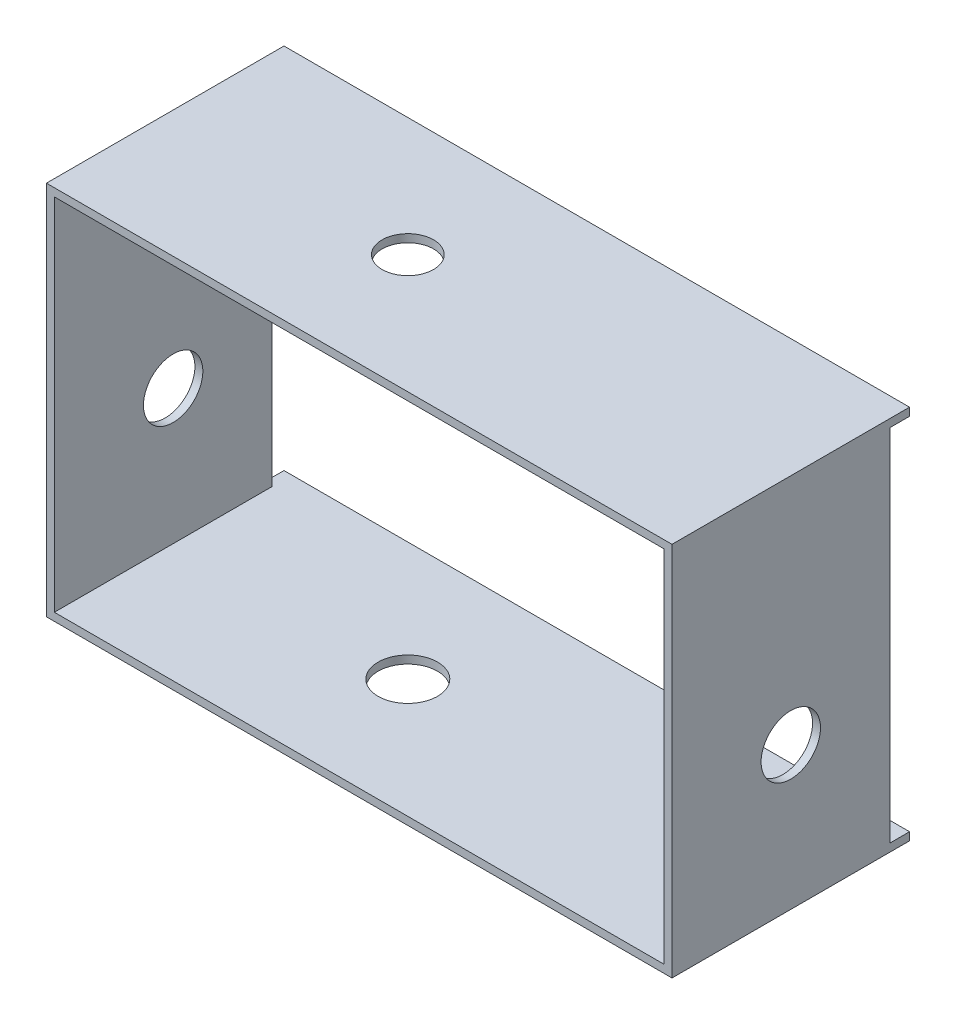
ISO-10303-21;
HEADER;
FILE_DESCRIPTION(('STEP AP214'),'2;1');
FILE_NAME('part.step','',(''),(''),'','','');
FILE_SCHEMA(('AUTOMOTIVE_DESIGN { 1 0 10303 214 1 1 1 1 }'));
ENDSEC;
DATA;
#1=APPLICATION_CONTEXT('core data for automotive mechanical design processes');
#2=APPLICATION_PROTOCOL_DEFINITION('international standard','automotive_design',2000,#1);
#3=PRODUCT_CONTEXT('',#1,'mechanical');
#4=PRODUCT('Part','Part','',(#3));
#5=PRODUCT_RELATED_PRODUCT_CATEGORY('part','',(#4));
#6=PRODUCT_DEFINITION_FORMATION('','',#4);
#7=PRODUCT_DEFINITION_CONTEXT('part definition',#1,'design');
#8=PRODUCT_DEFINITION('design','',#6,#7);
#9=PRODUCT_DEFINITION_SHAPE('','',#8);
#10=(LENGTH_UNIT() NAMED_UNIT(*) SI_UNIT(.MILLI.,.METRE.));
#11=(NAMED_UNIT(*) PLANE_ANGLE_UNIT() SI_UNIT($,.RADIAN.));
#12=(NAMED_UNIT(*) SI_UNIT($,.STERADIAN.) SOLID_ANGLE_UNIT());
#13=UNCERTAINTY_MEASURE_WITH_UNIT(LENGTH_MEASURE(1.E-05),#10,'distance_accuracy_value','');
#14=(GEOMETRIC_REPRESENTATION_CONTEXT(3) GLOBAL_UNCERTAINTY_ASSIGNED_CONTEXT((#13)) GLOBAL_UNIT_ASSIGNED_CONTEXT((#10,
#11,#12)) REPRESENTATION_CONTEXT('',''));
#15=CARTESIAN_POINT('',(0.,0.,0.));
#16=DIRECTION('',(0.,0.,1.));
#17=DIRECTION('',(1.,0.,0.));
#18=AXIS2_PLACEMENT_3D('',#15,#16,#17);
#19=CARTESIAN_POINT('',(195.58,0.,0.));
#20=DIRECTION('',(1.,0.,0.));
#21=DIRECTION('',(0.,0.,-1.));
#22=AXIS2_PLACEMENT_3D('',#19,#20,#21);
#23=PLANE('',#22);
#24=CARTESIAN_POINT('',(195.58,-72.2162450023476,-38.1));
#25=DIRECTION('',(1.,0.,0.));
#26=DIRECTION('',(0.,0.,-1.));
#27=AXIS2_PLACEMENT_3D('',#24,#25,#26);
#28=CIRCLE('',#27,9.525);
#29=CARTESIAN_POINT('',(195.58,-72.2162450023476,-47.625));
#30=VERTEX_POINT('',#29);
#31=EDGE_CURVE('E219',#30,#30,#28,.T.);
#32=ORIENTED_EDGE('',*,*,#31,.T.);
#33=EDGE_LOOP('',(#32));
#34=FACE_BOUND('',#33,.T.);
#35=DIRECTION('',(0.,0.,-1.));
#36=VECTOR('',#35,1.);
#37=CARTESIAN_POINT('',(195.58,-115.396245002348,0.));
#38=LINE('',#37,#36);
#39=CARTESIAN_POINT('',(195.58,-115.396245002348,6.56169603601951E-13));
#40=VERTEX_POINT('',#39);
#41=CARTESIAN_POINT('',(195.58,-115.396245002348,-69.85));
#42=VERTEX_POINT('',#41);
#43=EDGE_CURVE('E216',#40,#42,#38,.T.);
#44=ORIENTED_EDGE('',*,*,#43,.F.);
#45=DIRECTION('',(0.,-1.,0.));
#46=VECTOR('',#45,1.);
#47=CARTESIAN_POINT('',(195.58,0.,0.));
#48=LINE('',#47,#46);
#49=CARTESIAN_POINT('',(195.58,0.,0.));
#50=VERTEX_POINT('',#49);
#51=EDGE_CURVE('E225',#50,#40,#48,.T.);
#52=ORIENTED_EDGE('',*,*,#51,.F.);
#53=DIRECTION('',(0.,0.,-1.));
#54=VECTOR('',#53,1.);
#55=CARTESIAN_POINT('',(195.58,0.,0.));
#56=LINE('',#55,#54);
#57=CARTESIAN_POINT('',(195.58,0.,-69.85));
#58=VERTEX_POINT('',#57);
#59=EDGE_CURVE('E67',#50,#58,#56,.T.);
#60=ORIENTED_EDGE('',*,*,#59,.T.);
#61=DIRECTION('',(0.,-1.,0.));
#62=VECTOR('',#61,1.);
#63=CARTESIAN_POINT('',(195.58,0.,-69.85));
#64=LINE('',#63,#62);
#65=EDGE_CURVE('E256',#58,#42,#64,.T.);
#66=ORIENTED_EDGE('',*,*,#65,.T.);
#67=EDGE_LOOP('',(#44,#52,#60,#66));
#68=FACE_BOUND('',#67,.T.);
#69=ADVANCED_FACE('F41',(#34,#68),#23,.F.);
#70=CARTESIAN_POINT('',(0.,2.54,0.));
#71=DIRECTION('',(0.,-1.,0.));
#72=DIRECTION('',(0.,0.,-1.));
#73=AXIS2_PLACEMENT_3D('',#70,#71,#72);
#74=PLANE('',#73);
#75=DIRECTION('',(-1.,0.,0.));
#76=VECTOR('',#75,1.);
#77=CARTESIAN_POINT('',(0.,2.54,-76.2));
#78=LINE('',#77,#76);
#79=CARTESIAN_POINT('',(198.12,2.54,-76.2));
#80=VERTEX_POINT('',#79);
#81=CARTESIAN_POINT('',(-2.54,2.54,-76.2));
#82=VERTEX_POINT('',#81);
#83=EDGE_CURVE('E11',#80,#82,#78,.T.);
#84=ORIENTED_EDGE('',*,*,#83,.T.);
#85=DIRECTION('',(0.,0.,-1.));
#86=VECTOR('',#85,1.);
#87=CARTESIAN_POINT('',(-2.54,2.54,-76.2));
#88=LINE('',#87,#86);
#89=CARTESIAN_POINT('',(-2.54,2.54,0.));
#90=VERTEX_POINT('',#89);
#91=EDGE_CURVE('E139',#90,#82,#88,.T.);
#92=ORIENTED_EDGE('',*,*,#91,.F.);
#93=DIRECTION('',(1.,0.,0.));
#94=VECTOR('',#93,1.);
#95=CARTESIAN_POINT('',(0.,2.54,0.));
#96=LINE('',#95,#94);
#97=CARTESIAN_POINT('',(198.12,2.54,0.));
#98=VERTEX_POINT('',#97);
#99=EDGE_CURVE('E51',#90,#98,#96,.T.);
#100=ORIENTED_EDGE('',*,*,#99,.T.);
#101=DIRECTION('',(0.,0.,1.));
#102=VECTOR('',#101,1.);
#103=CARTESIAN_POINT('',(198.12,2.54,0.));
#104=LINE('',#103,#102);
#105=EDGE_CURVE('E141',#80,#98,#104,.T.);
#106=ORIENTED_EDGE('',*,*,#105,.F.);
#107=EDGE_LOOP('',(#84,#92,#100,#106));
#108=FACE_BOUND('',#107,.T.);
#109=CARTESIAN_POINT('',(75.2856,2.54,-38.1));
#110=DIRECTION('',(0.,1.,0.));
#111=DIRECTION('',(0.,0.,1.));
#112=AXIS2_PLACEMENT_3D('',#109,#110,#111);
#113=CIRCLE('',#112,8.255);
#114=CARTESIAN_POINT('',(75.2856,2.54,-29.845));
#115=VERTEX_POINT('',#114);
#116=EDGE_CURVE('E278',#115,#115,#113,.T.);
#117=ORIENTED_EDGE('',*,*,#116,.F.);
#118=EDGE_LOOP('',(#117));
#119=FACE_BOUND('',#118,.T.);
#120=ADVANCED_FACE('F136',(#108,#119),#74,.F.);
#121=CARTESIAN_POINT('',(0.,0.,0.));
#122=DIRECTION('',(0.,-1.,0.));
#123=DIRECTION('',(0.,0.,-1.));
#124=AXIS2_PLACEMENT_3D('',#121,#122,#123);
#125=PLANE('',#124);
#126=DIRECTION('',(0.,0.,1.));
#127=VECTOR('',#126,1.);
#128=CARTESIAN_POINT('',(0.,0.,0.));
#129=LINE('',#128,#127);
#130=CARTESIAN_POINT('',(0.,0.,-69.85));
#131=VERTEX_POINT('',#130);
#132=CARTESIAN_POINT('',(0.,0.,0.));
#133=VERTEX_POINT('',#132);
#134=EDGE_CURVE('E59',#131,#133,#129,.T.);
#135=ORIENTED_EDGE('',*,*,#134,.F.);
#136=DIRECTION('',(1.,0.,0.));
#137=VECTOR('',#136,1.);
#138=CARTESIAN_POINT('',(-2.54,0.,-69.85));
#139=LINE('',#138,#137);
#140=CARTESIAN_POINT('',(-2.54,0.,-69.85));
#141=VERTEX_POINT('',#140);
#142=EDGE_CURVE('E196',#141,#131,#139,.T.);
#143=ORIENTED_EDGE('',*,*,#142,.F.);
#144=DIRECTION('',(0.,0.,1.));
#145=VECTOR('',#144,1.);
#146=CARTESIAN_POINT('',(-2.54,0.,-69.85));
#147=LINE('',#146,#145);
#148=CARTESIAN_POINT('',(-2.54,0.,-76.2));
#149=VERTEX_POINT('',#148);
#150=EDGE_CURVE('E151',#149,#141,#147,.T.);
#151=ORIENTED_EDGE('',*,*,#150,.F.);
#152=DIRECTION('',(-1.,0.,0.));
#153=VECTOR('',#152,1.);
#154=CARTESIAN_POINT('',(0.,0.,-76.2));
#155=LINE('',#154,#153);
#156=CARTESIAN_POINT('',(198.12,0.,-76.2));
#157=VERTEX_POINT('',#156);
#158=EDGE_CURVE('E45',#157,#149,#155,.T.);
#159=ORIENTED_EDGE('',*,*,#158,.F.);
#160=DIRECTION('',(0.,0.,-1.));
#161=VECTOR('',#160,1.);
#162=CARTESIAN_POINT('',(198.12,0.,0.));
#163=LINE('',#162,#161);
#164=CARTESIAN_POINT('',(198.12,0.,-69.85));
#165=VERTEX_POINT('',#164);
#166=EDGE_CURVE('E233',#165,#157,#163,.T.);
#167=ORIENTED_EDGE('',*,*,#166,.F.);
#168=DIRECTION('',(-1.,0.,0.));
#169=VECTOR('',#168,1.);
#170=CARTESIAN_POINT('',(198.12,0.,-69.85));
#171=LINE('',#170,#169);
#172=EDGE_CURVE('E270',#165,#58,#171,.T.);
#173=ORIENTED_EDGE('',*,*,#172,.T.);
#174=ORIENTED_EDGE('',*,*,#59,.F.);
#175=DIRECTION('',(1.,0.,0.));
#176=VECTOR('',#175,1.);
#177=CARTESIAN_POINT('',(0.,0.,0.));
#178=LINE('',#177,#176);
#179=EDGE_CURVE('E282',#133,#50,#178,.T.);
#180=ORIENTED_EDGE('',*,*,#179,.F.);
#181=EDGE_LOOP('',(#135,#143,#151,#159,#167,#173,#174,#180));
#182=FACE_BOUND('',#181,.T.);
#183=CARTESIAN_POINT('',(75.2856,0.,-38.1));
#184=DIRECTION('',(0.,1.,0.));
#185=DIRECTION('',(0.,0.,1.));
#186=AXIS2_PLACEMENT_3D('',#183,#184,#185);
#187=CIRCLE('',#186,8.255);
#188=CARTESIAN_POINT('',(75.2856,0.,-29.845));
#189=VERTEX_POINT('',#188);
#190=EDGE_CURVE('E277',#189,#189,#187,.T.);
#191=ORIENTED_EDGE('',*,*,#190,.T.);
#192=EDGE_LOOP('',(#191));
#193=FACE_BOUND('',#192,.T.);
#194=ADVANCED_FACE('F293',(#182,#193),#125,.T.);
#195=CARTESIAN_POINT('',(0.,2.54,0.));
#196=DIRECTION('',(0.,0.,-1.));
#197=DIRECTION('',(-1.,0.,0.));
#198=AXIS2_PLACEMENT_3D('',#195,#196,#197);
#199=PLANE('',#198);
#200=DIRECTION('',(0.,1.,0.));
#201=VECTOR('',#200,1.);
#202=CARTESIAN_POINT('',(0.,2.54,0.));
#203=LINE('',#202,#201);
#204=CARTESIAN_POINT('',(0.,-115.396245002348,0.));
#205=VERTEX_POINT('',#204);
#206=EDGE_CURVE('E160',#205,#133,#203,.T.);
#207=ORIENTED_EDGE('',*,*,#206,.T.);
#208=ORIENTED_EDGE('',*,*,#179,.T.);
#209=ORIENTED_EDGE('',*,*,#51,.T.);
#210=DIRECTION('',(-1.,0.,0.));
#211=VECTOR('',#210,1.);
#212=CARTESIAN_POINT('',(198.12,-115.396245002348,6.56169603601951E-13));
#213=LINE('',#212,#211);
#214=EDGE_CURVE('E206',#40,#205,#213,.T.);
#215=ORIENTED_EDGE('',*,*,#214,.T.);
#216=EDGE_LOOP('',(#207,#208,#209,#215));
#217=FACE_BOUND('',#216,.T.);
#218=DIRECTION('',(-1.,0.,0.));
#219=VECTOR('',#218,1.);
#220=CARTESIAN_POINT('',(198.12,-117.936245002348,6.56169603601951E-13));
#221=LINE('',#220,#219);
#222=CARTESIAN_POINT('',(198.12,-117.936245002348,6.56169603601951E-13));
#223=VERTEX_POINT('',#222);
#224=CARTESIAN_POINT('',(-2.54,-117.936245002348,0.));
#225=VERTEX_POINT('',#224);
#226=EDGE_CURVE('E267',#223,#225,#221,.T.);
#227=ORIENTED_EDGE('',*,*,#226,.F.);
#228=DIRECTION('',(0.,-1.,0.));
#229=VECTOR('',#228,1.);
#230=CARTESIAN_POINT('',(198.12,0.,0.));
#231=LINE('',#230,#229);
#232=EDGE_CURVE('E242',#98,#223,#231,.T.);
#233=ORIENTED_EDGE('',*,*,#232,.F.);
#234=ORIENTED_EDGE('',*,*,#99,.F.);
#235=DIRECTION('',(0.,1.,0.));
#236=VECTOR('',#235,1.);
#237=CARTESIAN_POINT('',(-2.54,-115.396245002348,0.));
#238=LINE('',#237,#236);
#239=EDGE_CURVE('E158',#225,#90,#238,.T.);
#240=ORIENTED_EDGE('',*,*,#239,.F.);
#241=EDGE_LOOP('',(#227,#233,#234,#240));
#242=FACE_BOUND('',#241,.T.);
#243=ADVANCED_FACE('F43',(#217,#242),#199,.F.);
#244=CARTESIAN_POINT('',(0.,2.54,-76.2));
#245=DIRECTION('',(0.,0.,1.));
#246=DIRECTION('',(1.,0.,0.));
#247=AXIS2_PLACEMENT_3D('',#244,#245,#246);
#248=PLANE('',#247);
#249=ORIENTED_EDGE('',*,*,#158,.T.);
#250=DIRECTION('',(0.,-1.,0.));
#251=VECTOR('',#250,1.);
#252=CARTESIAN_POINT('',(-2.54,0.,-76.2));
#253=LINE('',#252,#251);
#254=EDGE_CURVE('E146',#82,#149,#253,.T.);
#255=ORIENTED_EDGE('',*,*,#254,.F.);
#256=ORIENTED_EDGE('',*,*,#83,.F.);
#257=DIRECTION('',(0.,1.,0.));
#258=VECTOR('',#257,1.);
#259=CARTESIAN_POINT('',(198.12,0.,-76.2));
#260=LINE('',#259,#258);
#261=EDGE_CURVE('E237',#157,#80,#260,.T.);
#262=ORIENTED_EDGE('',*,*,#261,.F.);
#263=EDGE_LOOP('',(#249,#255,#256,#262));
#264=FACE_BOUND('',#263,.T.);
#265=ADVANCED_FACE('F147',(#264),#248,.F.);
#266=CARTESIAN_POINT('',(75.2856,2.54,-38.1));
#267=DIRECTION('',(0.,-1.,0.));
#268=DIRECTION('',(0.,0.,-1.));
#269=AXIS2_PLACEMENT_3D('',#266,#267,#268);
#270=CYLINDRICAL_SURFACE('',#269,8.255);
#271=ORIENTED_EDGE('',*,*,#116,.T.);
#272=EDGE_LOOP('',(#271));
#273=FACE_BOUND('',#272,.T.);
#274=ORIENTED_EDGE('',*,*,#190,.F.);
#275=EDGE_LOOP('',(#274));
#276=FACE_BOUND('',#275,.T.);
#277=ADVANCED_FACE('F329',(#273,#276),#270,.F.);
#278=CARTESIAN_POINT('',(198.12,-115.396245002348,0.));
#279=DIRECTION('',(0.,1.,0.));
#280=DIRECTION('',(0.,0.,1.));
#281=AXIS2_PLACEMENT_3D('',#278,#279,#280);
#282=PLANE('',#281);
#283=DIRECTION('',(-1.,0.,0.));
#284=VECTOR('',#283,1.);
#285=CARTESIAN_POINT('',(198.12,-115.396245002348,-76.2));
#286=LINE('',#285,#284);
#287=CARTESIAN_POINT('',(198.12,-115.396245002348,-76.2));
#288=VERTEX_POINT('',#287);
#289=CARTESIAN_POINT('',(-2.54,-115.396245002348,-76.2));
#290=VERTEX_POINT('',#289);
#291=EDGE_CURVE('E252',#288,#290,#286,.T.);
#292=ORIENTED_EDGE('',*,*,#291,.T.);
#293=DIRECTION('',(0.,0.,-1.));
#294=VECTOR('',#293,1.);
#295=CARTESIAN_POINT('',(-2.54,-115.396245002348,-76.2));
#296=LINE('',#295,#294);
#297=CARTESIAN_POINT('',(-2.54,-115.396245002348,-69.85));
#298=VERTEX_POINT('',#297);
#299=EDGE_CURVE('E175',#298,#290,#296,.T.);
#300=ORIENTED_EDGE('',*,*,#299,.F.);
#301=DIRECTION('',(1.,0.,0.));
#302=VECTOR('',#301,1.);
#303=CARTESIAN_POINT('',(-2.54,-115.396245002348,-69.85));
#304=LINE('',#303,#302);
#305=CARTESIAN_POINT('',(0.,-115.396245002348,-69.85));
#306=VERTEX_POINT('',#305);
#307=EDGE_CURVE('E188',#298,#306,#304,.T.);
#308=ORIENTED_EDGE('',*,*,#307,.T.);
#309=DIRECTION('',(0.,0.,-1.));
#310=VECTOR('',#309,1.);
#311=CARTESIAN_POINT('',(0.,-115.396245002348,0.));
#312=LINE('',#311,#310);
#313=EDGE_CURVE('E213',#205,#306,#312,.T.);
#314=ORIENTED_EDGE('',*,*,#313,.F.);
#315=ORIENTED_EDGE('',*,*,#214,.F.);
#316=ORIENTED_EDGE('',*,*,#43,.T.);
#317=DIRECTION('',(-1.,0.,0.));
#318=VECTOR('',#317,1.);
#319=CARTESIAN_POINT('',(198.12,-115.396245002348,-69.85));
#320=LINE('',#319,#318);
#321=CARTESIAN_POINT('',(198.12,-115.396245002348,-69.85));
#322=VERTEX_POINT('',#321);
#323=EDGE_CURVE('E273',#322,#42,#320,.T.);
#324=ORIENTED_EDGE('',*,*,#323,.F.);
#325=DIRECTION('',(0.,0.,-1.));
#326=VECTOR('',#325,1.);
#327=CARTESIAN_POINT('',(198.12,-115.396245002348,0.));
#328=LINE('',#327,#326);
#329=EDGE_CURVE('E224',#322,#288,#328,.T.);
#330=ORIENTED_EDGE('',*,*,#329,.T.);
#331=EDGE_LOOP('',(#292,#300,#308,#314,#315,#316,#324,#330));
#332=FACE_BOUND('',#331,.T.);
#333=CARTESIAN_POINT('',(75.2856,-115.396245002348,-38.1));
#334=DIRECTION('',(0.,-1.,0.));
#335=DIRECTION('',(0.,0.,-1.));
#336=AXIS2_PLACEMENT_3D('',#333,#334,#335);
#337=CIRCLE('',#336,9.52500000000001);
#338=CARTESIAN_POINT('',(75.2856,-115.396245002348,-47.625));
#339=VERTEX_POINT('',#338);
#340=EDGE_CURVE('E202',#339,#339,#337,.T.);
#341=ORIENTED_EDGE('',*,*,#340,.T.);
#342=EDGE_LOOP('',(#341));
#343=FACE_BOUND('',#342,.T.);
#344=ADVANCED_FACE('F299',(#332,#343),#282,.T.);
#345=CARTESIAN_POINT('',(198.12,0.,-69.85));
#346=DIRECTION('',(0.,0.,-1.));
#347=DIRECTION('',(-1.,0.,0.));
#348=AXIS2_PLACEMENT_3D('',#345,#346,#347);
#349=PLANE('',#348);
#350=ORIENTED_EDGE('',*,*,#65,.F.);
#351=ORIENTED_EDGE('',*,*,#172,.F.);
#352=DIRECTION('',(0.,-1.,0.));
#353=VECTOR('',#352,1.);
#354=CARTESIAN_POINT('',(198.12,0.,-69.85));
#355=LINE('',#354,#353);
#356=EDGE_CURVE('E229',#165,#322,#355,.T.);
#357=ORIENTED_EDGE('',*,*,#356,.T.);
#358=ORIENTED_EDGE('',*,*,#323,.T.);
#359=EDGE_LOOP('',(#350,#351,#357,#358));
#360=FACE_BOUND('',#359,.T.);
#361=ADVANCED_FACE('F304',(#360),#349,.T.);
#362=CARTESIAN_POINT('',(198.12,-117.936245002348,0.));
#363=DIRECTION('',(0.,1.,0.));
#364=DIRECTION('',(0.,0.,1.));
#365=AXIS2_PLACEMENT_3D('',#362,#363,#364);
#366=PLANE('',#365);
#367=ORIENTED_EDGE('',*,*,#226,.T.);
#368=DIRECTION('',(0.,0.,1.));
#369=VECTOR('',#368,1.);
#370=CARTESIAN_POINT('',(-2.54,-117.936245002348,0.));
#371=LINE('',#370,#369);
#372=CARTESIAN_POINT('',(-2.54,-117.936245002348,-76.2));
#373=VERTEX_POINT('',#372);
#374=EDGE_CURVE('E183',#373,#225,#371,.T.);
#375=ORIENTED_EDGE('',*,*,#374,.F.);
#376=DIRECTION('',(-1.,0.,0.));
#377=VECTOR('',#376,1.);
#378=CARTESIAN_POINT('',(198.12,-117.936245002348,-76.2));
#379=LINE('',#378,#377);
#380=CARTESIAN_POINT('',(198.12,-117.936245002348,-76.2));
#381=VERTEX_POINT('',#380);
#382=EDGE_CURVE('E264',#381,#373,#379,.T.);
#383=ORIENTED_EDGE('',*,*,#382,.F.);
#384=DIRECTION('',(0.,0.,-1.));
#385=VECTOR('',#384,1.);
#386=CARTESIAN_POINT('',(198.12,-117.936245002348,0.));
#387=LINE('',#386,#385);
#388=EDGE_CURVE('E245',#223,#381,#387,.T.);
#389=ORIENTED_EDGE('',*,*,#388,.F.);
#390=EDGE_LOOP('',(#367,#375,#383,#389));
#391=FACE_BOUND('',#390,.T.);
#392=CARTESIAN_POINT('',(75.2856,-117.936245002348,-38.1));
#393=DIRECTION('',(0.,-1.,0.));
#394=DIRECTION('',(0.,0.,-1.));
#395=AXIS2_PLACEMENT_3D('',#392,#393,#394);
#396=CIRCLE('',#395,9.52500000000001);
#397=CARTESIAN_POINT('',(75.2856,-117.936245002348,-47.625));
#398=VERTEX_POINT('',#397);
#399=EDGE_CURVE('E201',#398,#398,#396,.T.);
#400=ORIENTED_EDGE('',*,*,#399,.F.);
#401=EDGE_LOOP('',(#400));
#402=FACE_BOUND('',#401,.T.);
#403=ADVANCED_FACE('F320',(#391,#402),#366,.F.);
#404=CARTESIAN_POINT('',(198.12,-72.2162450023476,-38.1));
#405=DIRECTION('',(-1.,0.,0.));
#406=DIRECTION('',(0.,0.,1.));
#407=AXIS2_PLACEMENT_3D('',#404,#405,#406);
#408=CYLINDRICAL_SURFACE('',#407,9.525);
#409=CARTESIAN_POINT('',(198.12,-72.2162450023476,-38.1));
#410=DIRECTION('',(1.,0.,0.));
#411=DIRECTION('',(0.,0.,-1.));
#412=AXIS2_PLACEMENT_3D('',#409,#410,#411);
#413=CIRCLE('',#412,9.525);
#414=CARTESIAN_POINT('',(198.12,-72.2162450023476,-47.625));
#415=VERTEX_POINT('',#414);
#416=EDGE_CURVE('E220',#415,#415,#413,.T.);
#417=ORIENTED_EDGE('',*,*,#416,.T.);
#418=EDGE_LOOP('',(#417));
#419=FACE_BOUND('',#418,.T.);
#420=ORIENTED_EDGE('',*,*,#31,.F.);
#421=EDGE_LOOP('',(#420));
#422=FACE_BOUND('',#421,.T.);
#423=ADVANCED_FACE('F344',(#419,#422),#408,.F.);
#424=CARTESIAN_POINT('',(198.12,0.,-76.2));
#425=DIRECTION('',(0.,0.,1.));
#426=DIRECTION('',(1.,0.,0.));
#427=AXIS2_PLACEMENT_3D('',#424,#425,#426);
#428=PLANE('',#427);
#429=ORIENTED_EDGE('',*,*,#382,.T.);
#430=DIRECTION('',(0.,-1.,0.));
#431=VECTOR('',#430,1.);
#432=CARTESIAN_POINT('',(-2.54,-117.936245002348,-76.2));
#433=LINE('',#432,#431);
#434=EDGE_CURVE('E179',#290,#373,#433,.T.);
#435=ORIENTED_EDGE('',*,*,#434,.F.);
#436=ORIENTED_EDGE('',*,*,#291,.F.);
#437=DIRECTION('',(0.,1.,0.));
#438=VECTOR('',#437,1.);
#439=CARTESIAN_POINT('',(198.12,0.,-76.2));
#440=LINE('',#439,#438);
#441=EDGE_CURVE('E249',#381,#288,#440,.T.);
#442=ORIENTED_EDGE('',*,*,#441,.F.);
#443=EDGE_LOOP('',(#429,#435,#436,#442));
#444=FACE_BOUND('',#443,.T.);
#445=ADVANCED_FACE('F316',(#444),#428,.F.);
#446=CARTESIAN_POINT('',(198.12,0.,0.));
#447=DIRECTION('',(1.,0.,0.));
#448=DIRECTION('',(0.,0.,-1.));
#449=AXIS2_PLACEMENT_3D('',#446,#447,#448);
#450=PLANE('',#449);
#451=ORIENTED_EDGE('',*,*,#329,.F.);
#452=ORIENTED_EDGE('',*,*,#356,.F.);
#453=ORIENTED_EDGE('',*,*,#166,.T.);
#454=ORIENTED_EDGE('',*,*,#261,.T.);
#455=ORIENTED_EDGE('',*,*,#105,.T.);
#456=ORIENTED_EDGE('',*,*,#232,.T.);
#457=ORIENTED_EDGE('',*,*,#388,.T.);
#458=ORIENTED_EDGE('',*,*,#441,.T.);
#459=EDGE_LOOP('',(#451,#452,#453,#454,#455,#456,#457,#458));
#460=FACE_BOUND('',#459,.T.);
#461=ORIENTED_EDGE('',*,*,#416,.F.);
#462=EDGE_LOOP('',(#461));
#463=FACE_BOUND('',#462,.T.);
#464=ADVANCED_FACE('F307',(#460,#463),#450,.T.);
#465=CARTESIAN_POINT('',(75.2856,-115.396245002348,-38.1));
#466=DIRECTION('',(0.,-1.,0.));
#467=DIRECTION('',(0.,0.,-1.));
#468=AXIS2_PLACEMENT_3D('',#465,#466,#467);
#469=CYLINDRICAL_SURFACE('',#468,9.52500000000001);
#470=ORIENTED_EDGE('',*,*,#340,.F.);
#471=EDGE_LOOP('',(#470));
#472=FACE_BOUND('',#471,.T.);
#473=ORIENTED_EDGE('',*,*,#399,.T.);
#474=EDGE_LOOP('',(#473));
#475=FACE_BOUND('',#474,.T.);
#476=ADVANCED_FACE('F374',(#472,#475),#469,.F.);
#477=CARTESIAN_POINT('',(-2.54,0.,0.));
#478=DIRECTION('',(1.,0.,0.));
#479=DIRECTION('',(0.,0.,-1.));
#480=AXIS2_PLACEMENT_3D('',#477,#478,#479);
#481=PLANE('',#480);
#482=ORIENTED_EDGE('',*,*,#91,.T.);
#483=ORIENTED_EDGE('',*,*,#254,.T.);
#484=ORIENTED_EDGE('',*,*,#150,.T.);
#485=DIRECTION('',(0.,-1.,0.));
#486=VECTOR('',#485,1.);
#487=CARTESIAN_POINT('',(-2.54,-115.396245002348,-69.85));
#488=LINE('',#487,#486);
#489=EDGE_CURVE('E172',#141,#298,#488,.T.);
#490=ORIENTED_EDGE('',*,*,#489,.T.);
#491=ORIENTED_EDGE('',*,*,#299,.T.);
#492=ORIENTED_EDGE('',*,*,#434,.T.);
#493=ORIENTED_EDGE('',*,*,#374,.T.);
#494=ORIENTED_EDGE('',*,*,#239,.T.);
#495=EDGE_LOOP('',(#482,#483,#484,#490,#491,#492,#493,#494));
#496=FACE_BOUND('',#495,.T.);
#497=CARTESIAN_POINT('',(-2.54,-72.2162450023476,-38.1));
#498=DIRECTION('',(-1.,0.,0.));
#499=DIRECTION('',(0.,0.,1.));
#500=AXIS2_PLACEMENT_3D('',#497,#498,#499);
#501=CIRCLE('',#500,9.525);
#502=CARTESIAN_POINT('',(-2.54,-72.2162450023476,-28.575));
#503=VERTEX_POINT('',#502);
#504=EDGE_CURVE('E191',#503,#503,#501,.T.);
#505=ORIENTED_EDGE('',*,*,#504,.F.);
#506=EDGE_LOOP('',(#505));
#507=FACE_BOUND('',#506,.T.);
#508=ADVANCED_FACE('F154',(#496,#507),#481,.F.);
#509=CARTESIAN_POINT('',(0.,0.,0.));
#510=DIRECTION('',(1.,0.,0.));
#511=DIRECTION('',(0.,0.,-1.));
#512=AXIS2_PLACEMENT_3D('',#509,#510,#511);
#513=PLANE('',#512);
#514=DIRECTION('',(0.,-1.,0.));
#515=VECTOR('',#514,1.);
#516=CARTESIAN_POINT('',(0.,-115.396245002348,-69.85));
#517=LINE('',#516,#515);
#518=EDGE_CURVE('E164',#131,#306,#517,.T.);
#519=ORIENTED_EDGE('',*,*,#518,.F.);
#520=ORIENTED_EDGE('',*,*,#134,.T.);
#521=ORIENTED_EDGE('',*,*,#206,.F.);
#522=ORIENTED_EDGE('',*,*,#313,.T.);
#523=EDGE_LOOP('',(#519,#520,#521,#522));
#524=FACE_BOUND('',#523,.T.);
#525=CARTESIAN_POINT('',(0.,-72.2162450023476,-38.1));
#526=DIRECTION('',(-1.,0.,0.));
#527=DIRECTION('',(0.,0.,1.));
#528=AXIS2_PLACEMENT_3D('',#525,#526,#527);
#529=CIRCLE('',#528,9.525);
#530=CARTESIAN_POINT('',(0.,-72.2162450023476,-28.575));
#531=VERTEX_POINT('',#530);
#532=EDGE_CURVE('E167',#531,#531,#529,.T.);
#533=ORIENTED_EDGE('',*,*,#532,.T.);
#534=EDGE_LOOP('',(#533));
#535=FACE_BOUND('',#534,.T.);
#536=ADVANCED_FACE('F432',(#524,#535),#513,.T.);
#537=CARTESIAN_POINT('',(-2.54,-115.396245002348,-69.85));
#538=DIRECTION('',(0.,0.,1.));
#539=DIRECTION('',(1.,0.,0.));
#540=AXIS2_PLACEMENT_3D('',#537,#538,#539);
#541=PLANE('',#540);
#542=ORIENTED_EDGE('',*,*,#518,.T.);
#543=ORIENTED_EDGE('',*,*,#307,.F.);
#544=ORIENTED_EDGE('',*,*,#489,.F.);
#545=ORIENTED_EDGE('',*,*,#142,.T.);
#546=EDGE_LOOP('',(#542,#543,#544,#545));
#547=FACE_BOUND('',#546,.T.);
#548=ADVANCED_FACE('F441',(#547),#541,.F.);
#549=CARTESIAN_POINT('',(-2.54,-72.2162450023476,-38.1));
#550=DIRECTION('',(1.,0.,0.));
#551=DIRECTION('',(0.,0.,-1.));
#552=AXIS2_PLACEMENT_3D('',#549,#550,#551);
#553=CYLINDRICAL_SURFACE('',#552,9.525);
#554=ORIENTED_EDGE('',*,*,#504,.T.);
#555=EDGE_LOOP('',(#554));
#556=FACE_BOUND('',#555,.T.);
#557=ORIENTED_EDGE('',*,*,#532,.F.);
#558=EDGE_LOOP('',(#557));
#559=FACE_BOUND('',#558,.T.);
#560=ADVANCED_FACE('F451',(#556,#559),#553,.F.);
#561=CLOSED_SHELL('',(#69,#120,#194,#243,#265,#277,#344,#361,#403,#423,#445,#464,#476,#508,#536,
#548,#560));
#562=MANIFOLD_SOLID_BREP('B2',#561);
#563=ADVANCED_BREP_SHAPE_REPRESENTATION('',(#18,#562),#14);
#564=SHAPE_DEFINITION_REPRESENTATION(#9,#563);
ENDSEC;
END-ISO-10303-21;
